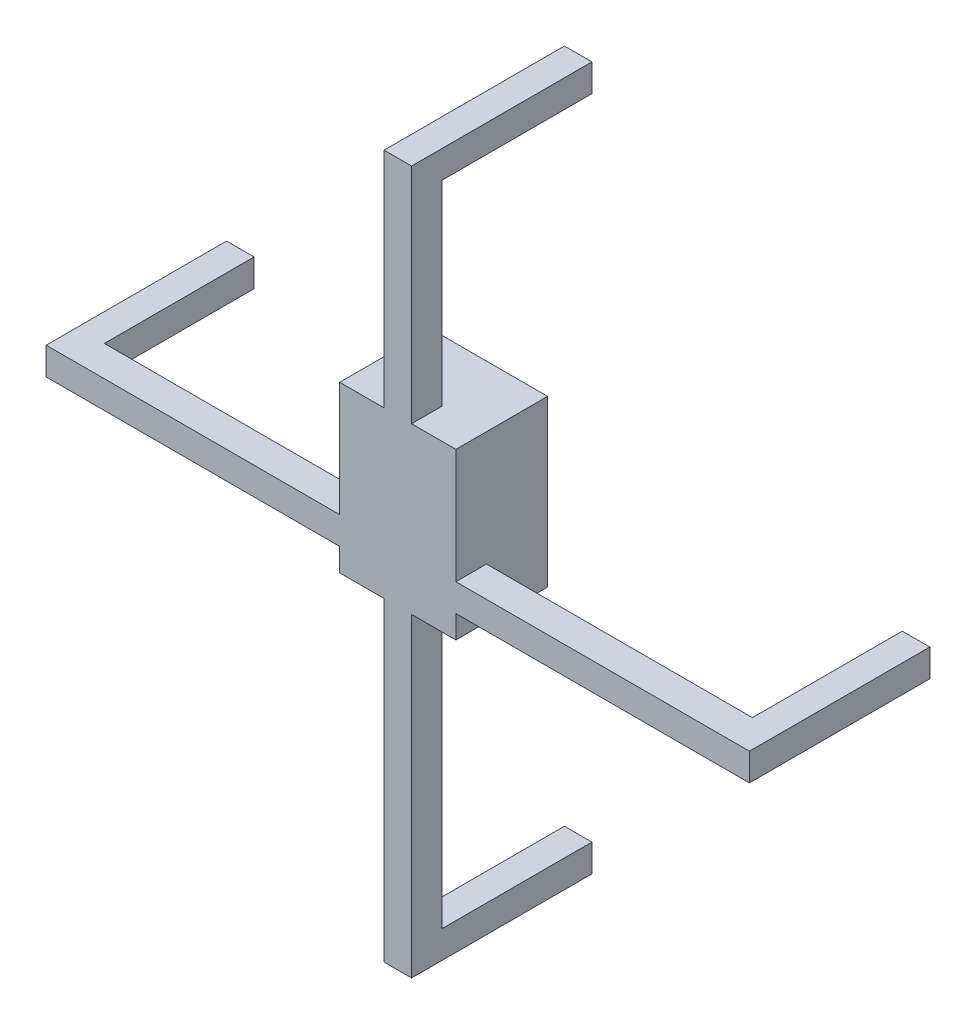
ISO-10303-21;
HEADER;
FILE_DESCRIPTION(('STEP AP214'),'2;1');
FILE_NAME('part.step','',(''),(''),'','','');
FILE_SCHEMA(('AUTOMOTIVE_DESIGN { 1 0 10303 214 1 1 1 1 }'));
ENDSEC;
DATA;
#1=APPLICATION_CONTEXT('core data for automotive mechanical design processes');
#2=APPLICATION_PROTOCOL_DEFINITION('international standard','automotive_design',2000,#1);
#3=PRODUCT_CONTEXT('',#1,'mechanical');
#4=PRODUCT('Part','Part','',(#3));
#5=PRODUCT_RELATED_PRODUCT_CATEGORY('part','',(#4));
#6=PRODUCT_DEFINITION_FORMATION('','',#4);
#7=PRODUCT_DEFINITION_CONTEXT('part definition',#1,'design');
#8=PRODUCT_DEFINITION('design','',#6,#7);
#9=PRODUCT_DEFINITION_SHAPE('','',#8);
#10=(LENGTH_UNIT() NAMED_UNIT(*) SI_UNIT(.MILLI.,.METRE.));
#11=(NAMED_UNIT(*) PLANE_ANGLE_UNIT() SI_UNIT($,.RADIAN.));
#12=(NAMED_UNIT(*) SI_UNIT($,.STERADIAN.) SOLID_ANGLE_UNIT());
#13=UNCERTAINTY_MEASURE_WITH_UNIT(LENGTH_MEASURE(1.E-05),#10,'distance_accuracy_value','');
#14=(GEOMETRIC_REPRESENTATION_CONTEXT(3) GLOBAL_UNCERTAINTY_ASSIGNED_CONTEXT((#13)) GLOBAL_UNIT_ASSIGNED_CONTEXT((#10,
#11,#12)) REPRESENTATION_CONTEXT('',''));
#15=CARTESIAN_POINT('',(0.,0.,0.));
#16=DIRECTION('',(0.,0.,1.));
#17=DIRECTION('',(1.,0.,0.));
#18=AXIS2_PLACEMENT_3D('',#15,#16,#17);
#19=CARTESIAN_POINT('',(0.,0.25,0.));
#20=DIRECTION('',(0.,1.,0.));
#21=DIRECTION('',(0.,0.,1.));
#22=AXIS2_PLACEMENT_3D('',#19,#20,#21);
#23=PLANE('',#22);
#24=DIRECTION('',(0.,0.,1.));
#25=VECTOR('',#24,1.);
#26=CARTESIAN_POINT('',(-57.5,0.25,3.99999999999999));
#27=LINE('',#26,#25);
#28=CARTESIAN_POINT('',(-57.5,0.25,-25.5));
#29=VERTEX_POINT('',#28);
#30=CARTESIAN_POINT('',(-57.5,0.25,3.99999999999999));
#31=VERTEX_POINT('',#30);
#32=EDGE_CURVE('E406',#29,#31,#27,.T.);
#33=ORIENTED_EDGE('',*,*,#32,.F.);
#34=DIRECTION('',(1.,0.,0.));
#35=VECTOR('',#34,1.);
#36=CARTESIAN_POINT('',(0.,0.25,-25.5));
#37=LINE('',#36,#35);
#38=CARTESIAN_POINT('',(-53.,0.25,-25.5));
#39=VERTEX_POINT('',#38);
#40=EDGE_CURVE('E565',#29,#39,#37,.T.);
#41=ORIENTED_EDGE('',*,*,#40,.T.);
#42=DIRECTION('',(0.,0.,-1.));
#43=VECTOR('',#42,1.);
#44=CARTESIAN_POINT('',(-53.,0.25,-27.5));
#45=LINE('',#44,#43);
#46=CARTESIAN_POINT('',(-53.,0.25,-1.00000000000001));
#47=VERTEX_POINT('',#46);
#48=EDGE_CURVE('E402',#47,#39,#45,.T.);
#49=ORIENTED_EDGE('',*,*,#48,.F.);
#50=DIRECTION('',(-1.,0.,0.));
#51=VECTOR('',#50,1.);
#52=CARTESIAN_POINT('',(-53.,0.25,-1.00000000000001));
#53=LINE('',#52,#51);
#54=CARTESIAN_POINT('',(-9.49999999999999,0.25,-1.00000000000001));
#55=VERTEX_POINT('',#54);
#56=EDGE_CURVE('E397',#55,#47,#53,.T.);
#57=ORIENTED_EDGE('',*,*,#56,.F.);
#58=DIRECTION('',(0.,0.,-1.));
#59=VECTOR('',#58,1.);
#60=CARTESIAN_POINT('',(-9.49999999999999,0.25,0.));
#61=LINE('',#60,#59);
#62=CARTESIAN_POINT('',(-9.49999999999999,0.25,4.));
#63=VERTEX_POINT('',#62);
#64=EDGE_CURVE('E492',#63,#55,#61,.T.);
#65=ORIENTED_EDGE('',*,*,#64,.F.);
#66=DIRECTION('',(1.,0.,0.));
#67=VECTOR('',#66,1.);
#68=CARTESIAN_POINT('',(-57.5,0.25,3.99999999999999));
#69=LINE('',#68,#67);
#70=EDGE_CURVE('E410',#31,#63,#69,.T.);
#71=ORIENTED_EDGE('',*,*,#70,.F.);
#72=EDGE_LOOP('',(#33,#41,#49,#57,#65,#71));
#73=FACE_BOUND('',#72,.T.);
#74=ADVANCED_FACE('F38',(#73),#23,.F.);
#75=CARTESIAN_POINT('',(0.,4.75,0.));
#76=DIRECTION('',(0.,1.,0.));
#77=DIRECTION('',(0.,0.,1.));
#78=AXIS2_PLACEMENT_3D('',#75,#76,#77);
#79=PLANE('',#78);
#80=DIRECTION('',(1.,0.,0.));
#81=VECTOR('',#80,1.);
#82=CARTESIAN_POINT('',(0.,4.75,-25.5));
#83=LINE('',#82,#81);
#84=CARTESIAN_POINT('',(-57.5,4.75,-25.5));
#85=VERTEX_POINT('',#84);
#86=CARTESIAN_POINT('',(-53.,4.75,-25.5));
#87=VERTEX_POINT('',#86);
#88=EDGE_CURVE('E62',#85,#87,#83,.T.);
#89=ORIENTED_EDGE('',*,*,#88,.F.);
#90=DIRECTION('',(0.,0.,1.));
#91=VECTOR('',#90,1.);
#92=CARTESIAN_POINT('',(-57.5,4.75,3.99999999999999));
#93=LINE('',#92,#91);
#94=CARTESIAN_POINT('',(-57.5,4.75,3.99999999999999));
#95=VERTEX_POINT('',#94);
#96=EDGE_CURVE('E382',#85,#95,#93,.T.);
#97=ORIENTED_EDGE('',*,*,#96,.T.);
#98=DIRECTION('',(1.,0.,0.));
#99=VECTOR('',#98,1.);
#100=CARTESIAN_POINT('',(-57.5,4.75,3.99999999999999));
#101=LINE('',#100,#99);
#102=CARTESIAN_POINT('',(-9.49999999999999,4.75,4.));
#103=VERTEX_POINT('',#102);
#104=EDGE_CURVE('E386',#95,#103,#101,.T.);
#105=ORIENTED_EDGE('',*,*,#104,.T.);
#106=DIRECTION('',(0.,0.,-1.));
#107=VECTOR('',#106,1.);
#108=CARTESIAN_POINT('',(-9.49999999999999,4.75,0.));
#109=LINE('',#108,#107);
#110=CARTESIAN_POINT('',(-9.49999999999999,4.75,-1.00000000000001));
#111=VERTEX_POINT('',#110);
#112=EDGE_CURVE('E489',#103,#111,#109,.T.);
#113=ORIENTED_EDGE('',*,*,#112,.T.);
#114=DIRECTION('',(-1.,0.,0.));
#115=VECTOR('',#114,1.);
#116=CARTESIAN_POINT('',(-53.,4.75,-1.00000000000001));
#117=LINE('',#116,#115);
#118=CARTESIAN_POINT('',(-53.,4.75,-1.00000000000001));
#119=VERTEX_POINT('',#118);
#120=EDGE_CURVE('E373',#111,#119,#117,.T.);
#121=ORIENTED_EDGE('',*,*,#120,.T.);
#122=DIRECTION('',(0.,0.,-1.));
#123=VECTOR('',#122,1.);
#124=CARTESIAN_POINT('',(-53.,4.75,-27.5));
#125=LINE('',#124,#123);
#126=EDGE_CURVE('E378',#119,#87,#125,.T.);
#127=ORIENTED_EDGE('',*,*,#126,.T.);
#128=EDGE_LOOP('',(#89,#97,#105,#113,#121,#127));
#129=FACE_BOUND('',#128,.T.);
#130=ADVANCED_FACE('F600',(#129),#79,.T.);
#131=DIRECTION('',(0.,0.,1.));
#132=VECTOR('',#131,1.);
#133=CARTESIAN_POINT('',(53.,0.25,-27.5));
#134=LINE('',#133,#132);
#135=CARTESIAN_POINT('',(53.,0.25,-25.5));
#136=VERTEX_POINT('',#135);
#137=CARTESIAN_POINT('',(53.,0.25,-1.00000000000001));
#138=VERTEX_POINT('',#137);
#139=EDGE_CURVE('E394',#136,#138,#134,.T.);
#140=ORIENTED_EDGE('',*,*,#139,.F.);
#141=DIRECTION('',(1.,0.,0.));
#142=VECTOR('',#141,1.);
#143=CARTESIAN_POINT('',(0.,0.25,-25.5));
#144=LINE('',#143,#142);
#145=CARTESIAN_POINT('',(57.5,0.25,-25.5));
#146=VERTEX_POINT('',#145);
#147=EDGE_CURVE('E577',#136,#146,#144,.T.);
#148=ORIENTED_EDGE('',*,*,#147,.T.);
#149=DIRECTION('',(0.,0.,-1.));
#150=VECTOR('',#149,1.);
#151=CARTESIAN_POINT('',(57.5,0.25,3.99999999999999));
#152=LINE('',#151,#150);
#153=CARTESIAN_POINT('',(57.5,0.25,3.99999999999999));
#154=VERTEX_POINT('',#153);
#155=EDGE_CURVE('E414',#154,#146,#152,.T.);
#156=ORIENTED_EDGE('',*,*,#155,.F.);
#157=CARTESIAN_POINT('',(9.49999999999999,0.25,3.99999999999999));
#158=VERTEX_POINT('',#157);
#159=EDGE_CURVE('E409',#158,#154,#69,.T.);
#160=ORIENTED_EDGE('',*,*,#159,.F.);
#161=DIRECTION('',(0.,0.,1.));
#162=VECTOR('',#161,1.);
#163=CARTESIAN_POINT('',(9.5,0.25,0.));
#164=LINE('',#163,#162);
#165=CARTESIAN_POINT('',(9.50000000000001,0.25,-1.00000000000001));
#166=VERTEX_POINT('',#165);
#167=EDGE_CURVE('E485',#166,#158,#164,.T.);
#168=ORIENTED_EDGE('',*,*,#167,.F.);
#169=EDGE_CURVE('E398',#138,#166,#53,.T.);
#170=ORIENTED_EDGE('',*,*,#169,.F.);
#171=EDGE_LOOP('',(#140,#148,#156,#160,#168,#170));
#172=FACE_BOUND('',#171,.T.);
#173=ADVANCED_FACE('F626',(#172),#23,.F.);
#174=DIRECTION('',(1.,0.,0.));
#175=VECTOR('',#174,1.);
#176=CARTESIAN_POINT('',(0.,4.75,-25.5));
#177=LINE('',#176,#175);
#178=CARTESIAN_POINT('',(53.,4.75,-25.5));
#179=VERTEX_POINT('',#178);
#180=CARTESIAN_POINT('',(57.5,4.75,-25.5));
#181=VERTEX_POINT('',#180);
#182=EDGE_CURVE('E54',#179,#181,#177,.T.);
#183=ORIENTED_EDGE('',*,*,#182,.F.);
#184=DIRECTION('',(0.,0.,1.));
#185=VECTOR('',#184,1.);
#186=CARTESIAN_POINT('',(53.,4.75,-27.5));
#187=LINE('',#186,#185);
#188=CARTESIAN_POINT('',(53.,4.75,-1.00000000000001));
#189=VERTEX_POINT('',#188);
#190=EDGE_CURVE('E370',#179,#189,#187,.T.);
#191=ORIENTED_EDGE('',*,*,#190,.T.);
#192=CARTESIAN_POINT('',(9.50000000000003,4.75,-1.00000000000001));
#193=VERTEX_POINT('',#192);
#194=EDGE_CURVE('E374',#189,#193,#117,.T.);
#195=ORIENTED_EDGE('',*,*,#194,.T.);
#196=DIRECTION('',(0.,0.,1.));
#197=VECTOR('',#196,1.);
#198=CARTESIAN_POINT('',(9.5,4.75,0.));
#199=LINE('',#198,#197);
#200=CARTESIAN_POINT('',(9.49999999999999,4.75,3.99999999999999));
#201=VERTEX_POINT('',#200);
#202=EDGE_CURVE('E482',#193,#201,#199,.T.);
#203=ORIENTED_EDGE('',*,*,#202,.T.);
#204=CARTESIAN_POINT('',(57.5,4.75,3.99999999999999));
#205=VERTEX_POINT('',#204);
#206=EDGE_CURVE('E385',#201,#205,#101,.T.);
#207=ORIENTED_EDGE('',*,*,#206,.T.);
#208=DIRECTION('',(0.,0.,-1.));
#209=VECTOR('',#208,1.);
#210=CARTESIAN_POINT('',(57.5,4.75,3.99999999999999));
#211=LINE('',#210,#209);
#212=EDGE_CURVE('E390',#205,#181,#211,.T.);
#213=ORIENTED_EDGE('',*,*,#212,.T.);
#214=EDGE_LOOP('',(#183,#191,#195,#203,#207,#213));
#215=FACE_BOUND('',#214,.T.);
#216=ADVANCED_FACE('F635',(#215),#79,.T.);
#217=CARTESIAN_POINT('',(-2.25,0.,0.));
#218=DIRECTION('',(1.,0.,0.));
#219=DIRECTION('',(0.,0.,-1.));
#220=AXIS2_PLACEMENT_3D('',#217,#218,#219);
#221=PLANE('',#220);
#222=DIRECTION('',(0.,0.,1.));
#223=VECTOR('',#222,1.);
#224=CARTESIAN_POINT('',(-2.25,60.,3.99999999999927));
#225=LINE('',#224,#223);
#226=CARTESIAN_POINT('',(-2.25,60.,-25.5));
#227=VERTEX_POINT('',#226);
#228=CARTESIAN_POINT('',(-2.25,60.,3.99999999999927));
#229=VERTEX_POINT('',#228);
#230=EDGE_CURVE('E522',#227,#229,#225,.T.);
#231=ORIENTED_EDGE('',*,*,#230,.F.);
#232=DIRECTION('',(0.,-1.,0.));
#233=VECTOR('',#232,1.);
#234=CARTESIAN_POINT('',(-2.25,0.,-25.5));
#235=LINE('',#234,#233);
#236=CARTESIAN_POINT('',(-2.25,55.5,-25.5));
#237=VERTEX_POINT('',#236);
#238=EDGE_CURVE('E553',#227,#237,#235,.T.);
#239=ORIENTED_EDGE('',*,*,#238,.T.);
#240=DIRECTION('',(0.,0.,-1.));
#241=VECTOR('',#240,1.);
#242=CARTESIAN_POINT('',(-2.25,55.5,-27.5));
#243=LINE('',#242,#241);
#244=CARTESIAN_POINT('',(-2.25,55.5,-1.));
#245=VERTEX_POINT('',#244);
#246=EDGE_CURVE('E519',#245,#237,#243,.T.);
#247=ORIENTED_EDGE('',*,*,#246,.F.);
#248=DIRECTION('',(0.,1.,0.));
#249=VECTOR('',#248,1.);
#250=CARTESIAN_POINT('',(-2.25,-50.5,-1.00000000000074));
#251=LINE('',#250,#249);
#252=CARTESIAN_POINT('',(-2.25,23.5,-1.00000000000001));
#253=VERTEX_POINT('',#252);
#254=EDGE_CURVE('E514',#253,#245,#251,.T.);
#255=ORIENTED_EDGE('',*,*,#254,.F.);
#256=DIRECTION('',(0.,0.,-1.));
#257=VECTOR('',#256,1.);
#258=CARTESIAN_POINT('',(-2.25,23.5,0.));
#259=LINE('',#258,#257);
#260=CARTESIAN_POINT('',(-2.25,23.5,4.));
#261=VERTEX_POINT('',#260);
#262=EDGE_CURVE('E479',#261,#253,#259,.T.);
#263=ORIENTED_EDGE('',*,*,#262,.F.);
#264=DIRECTION('',(0.,-1.,0.));
#265=VECTOR('',#264,1.);
#266=CARTESIAN_POINT('',(-2.25,-55.,3.99999999999926));
#267=LINE('',#266,#265);
#268=EDGE_CURVE('E272',#229,#261,#267,.T.);
#269=ORIENTED_EDGE('',*,*,#268,.F.);
#270=EDGE_LOOP('',(#231,#239,#247,#255,#263,#269));
#271=FACE_BOUND('',#270,.T.);
#272=ADVANCED_FACE('F661',(#271),#221,.F.);
#273=CARTESIAN_POINT('',(2.25,0.,0.));
#274=DIRECTION('',(1.,0.,0.));
#275=DIRECTION('',(0.,0.,-1.));
#276=AXIS2_PLACEMENT_3D('',#273,#274,#275);
#277=PLANE('',#276);
#278=DIRECTION('',(0.,-1.,0.));
#279=VECTOR('',#278,1.);
#280=CARTESIAN_POINT('',(2.25,0.,-25.5));
#281=LINE('',#280,#279);
#282=CARTESIAN_POINT('',(2.25,60.,-25.5));
#283=VERTEX_POINT('',#282);
#284=CARTESIAN_POINT('',(2.25,55.5,-25.5));
#285=VERTEX_POINT('',#284);
#286=EDGE_CURVE('E547',#283,#285,#281,.T.);
#287=ORIENTED_EDGE('',*,*,#286,.F.);
#288=DIRECTION('',(0.,0.,1.));
#289=VECTOR('',#288,1.);
#290=CARTESIAN_POINT('',(2.25,60.,3.99999999999927));
#291=LINE('',#290,#289);
#292=CARTESIAN_POINT('',(2.25,60.,3.99999999999927));
#293=VERTEX_POINT('',#292);
#294=EDGE_CURVE('E502',#283,#293,#291,.T.);
#295=ORIENTED_EDGE('',*,*,#294,.T.);
#296=DIRECTION('',(0.,-1.,0.));
#297=VECTOR('',#296,1.);
#298=CARTESIAN_POINT('',(2.25,-55.,3.99999999999926));
#299=LINE('',#298,#297);
#300=CARTESIAN_POINT('',(2.25,23.5,3.99999999999927));
#301=VERTEX_POINT('',#300);
#302=EDGE_CURVE('E505',#293,#301,#299,.T.);
#303=ORIENTED_EDGE('',*,*,#302,.T.);
#304=DIRECTION('',(0.,0.,-1.));
#305=VECTOR('',#304,1.);
#306=CARTESIAN_POINT('',(2.25,23.5,0.));
#307=LINE('',#306,#305);
#308=CARTESIAN_POINT('',(2.25,23.4999999999999,-1.00000000000022));
#309=VERTEX_POINT('',#308);
#310=EDGE_CURVE('E476',#301,#309,#307,.T.);
#311=ORIENTED_EDGE('',*,*,#310,.T.);
#312=DIRECTION('',(0.,1.,0.));
#313=VECTOR('',#312,1.);
#314=CARTESIAN_POINT('',(2.25,-50.5,-1.00000000000074));
#315=LINE('',#314,#313);
#316=CARTESIAN_POINT('',(2.25,55.5,-1.));
#317=VERTEX_POINT('',#316);
#318=EDGE_CURVE('E495',#309,#317,#315,.T.);
#319=ORIENTED_EDGE('',*,*,#318,.T.);
#320=DIRECTION('',(0.,0.,-1.));
#321=VECTOR('',#320,1.);
#322=CARTESIAN_POINT('',(2.25,55.5,-27.5));
#323=LINE('',#322,#321);
#324=EDGE_CURVE('E498',#317,#285,#323,.T.);
#325=ORIENTED_EDGE('',*,*,#324,.T.);
#326=EDGE_LOOP('',(#287,#295,#303,#311,#319,#325));
#327=FACE_BOUND('',#326,.T.);
#328=ADVANCED_FACE('F669',(#327),#277,.T.);
#329=DIRECTION('',(0.,0.,1.));
#330=VECTOR('',#329,1.);
#331=CARTESIAN_POINT('',(-2.25,-50.4999999999996,-27.5000000000007));
#332=LINE('',#331,#330);
#333=CARTESIAN_POINT('',(-2.25,-50.4999999999998,-25.5));
#334=VERTEX_POINT('',#333);
#335=CARTESIAN_POINT('',(-2.25,-50.5,-1.00000000000074));
#336=VERTEX_POINT('',#335);
#337=EDGE_CURVE('E263',#334,#336,#332,.T.);
#338=ORIENTED_EDGE('',*,*,#337,.F.);
#339=DIRECTION('',(0.,-1.,0.));
#340=VECTOR('',#339,1.);
#341=CARTESIAN_POINT('',(-2.25,0.,-25.5));
#342=LINE('',#341,#340);
#343=CARTESIAN_POINT('',(-2.25,-54.9999999999997,-25.5));
#344=VERTEX_POINT('',#343);
#345=EDGE_CURVE('E248',#334,#344,#342,.T.);
#346=ORIENTED_EDGE('',*,*,#345,.T.);
#347=DIRECTION('',(0.,0.,-1.));
#348=VECTOR('',#347,1.);
#349=CARTESIAN_POINT('',(-2.25,-55.,3.99999999999926));
#350=LINE('',#349,#348);
#351=CARTESIAN_POINT('',(-2.25,-55.,3.99999999999926));
#352=VERTEX_POINT('',#351);
#353=EDGE_CURVE('E261',#352,#344,#350,.T.);
#354=ORIENTED_EDGE('',*,*,#353,.F.);
#355=CARTESIAN_POINT('',(-2.25,-3.50000000000002,3.99999999999927));
#356=VERTEX_POINT('',#355);
#357=EDGE_CURVE('E279',#356,#352,#267,.T.);
#358=ORIENTED_EDGE('',*,*,#357,.F.);
#359=DIRECTION('',(0.,0.,1.));
#360=VECTOR('',#359,1.);
#361=CARTESIAN_POINT('',(-2.25,-3.5,0.));
#362=LINE('',#361,#360);
#363=CARTESIAN_POINT('',(-2.25,-3.5,-1.00000000000001));
#364=VERTEX_POINT('',#363);
#365=EDGE_CURVE('E472',#364,#356,#362,.T.);
#366=ORIENTED_EDGE('',*,*,#365,.F.);
#367=EDGE_CURVE('E515',#336,#364,#251,.T.);
#368=ORIENTED_EDGE('',*,*,#367,.F.);
#369=EDGE_LOOP('',(#338,#346,#354,#358,#366,#368));
#370=FACE_BOUND('',#369,.T.);
#371=ADVANCED_FACE('F259',(#370),#221,.F.);
#372=DIRECTION('',(0.,-1.,0.));
#373=VECTOR('',#372,1.);
#374=CARTESIAN_POINT('',(2.25,0.,-25.5));
#375=LINE('',#374,#373);
#376=CARTESIAN_POINT('',(2.25,-50.4999999999998,-25.5));
#377=VERTEX_POINT('',#376);
#378=CARTESIAN_POINT('',(2.25,-54.9999999999997,-25.5));
#379=VERTEX_POINT('',#378);
#380=EDGE_CURVE('E251',#377,#379,#375,.T.);
#381=ORIENTED_EDGE('',*,*,#380,.F.);
#382=DIRECTION('',(0.,0.,1.));
#383=VECTOR('',#382,1.);
#384=CARTESIAN_POINT('',(2.25,-50.4999999999996,-27.5000000000007));
#385=LINE('',#384,#383);
#386=CARTESIAN_POINT('',(2.25,-50.5,-1.00000000000074));
#387=VERTEX_POINT('',#386);
#388=EDGE_CURVE('E511',#377,#387,#385,.T.);
#389=ORIENTED_EDGE('',*,*,#388,.T.);
#390=CARTESIAN_POINT('',(2.25,-3.50000000000002,-1.00000000000041));
#391=VERTEX_POINT('',#390);
#392=EDGE_CURVE('E441',#387,#391,#315,.T.);
#393=ORIENTED_EDGE('',*,*,#392,.T.);
#394=DIRECTION('',(0.,0.,1.));
#395=VECTOR('',#394,1.);
#396=CARTESIAN_POINT('',(2.25,-3.5,0.));
#397=LINE('',#396,#395);
#398=CARTESIAN_POINT('',(2.25,-3.5,4.));
#399=VERTEX_POINT('',#398);
#400=EDGE_CURVE('E47',#391,#399,#397,.T.);
#401=ORIENTED_EDGE('',*,*,#400,.T.);
#402=CARTESIAN_POINT('',(2.25,-55.,3.99999999999926));
#403=VERTEX_POINT('',#402);
#404=EDGE_CURVE('E439',#399,#403,#299,.T.);
#405=ORIENTED_EDGE('',*,*,#404,.T.);
#406=DIRECTION('',(0.,0.,-1.));
#407=VECTOR('',#406,1.);
#408=CARTESIAN_POINT('',(2.25,-55.,3.99999999999926));
#409=LINE('',#408,#407);
#410=EDGE_CURVE('E508',#403,#379,#409,.T.);
#411=ORIENTED_EDGE('',*,*,#410,.T.);
#412=EDGE_LOOP('',(#381,#389,#393,#401,#405,#411));
#413=FACE_BOUND('',#412,.T.);
#414=ADVANCED_FACE('F438',(#413),#277,.T.);
#415=CARTESIAN_POINT('',(-53.,0.25,-1.00000000000001));
#416=DIRECTION('',(0.,0.,-1.));
#417=DIRECTION('',(-1.,0.,0.));
#418=AXIS2_PLACEMENT_3D('',#415,#416,#417);
#419=PLANE('',#418);
#420=ORIENTED_EDGE('',*,*,#169,.T.);
#421=DIRECTION('',(0.,-1.,0.));
#422=VECTOR('',#421,1.);
#423=CARTESIAN_POINT('',(9.5,-2.50000000000003,-1.00000000000001));
#424=LINE('',#423,#422);
#425=EDGE_CURVE('E328',#193,#166,#424,.T.);
#426=ORIENTED_EDGE('',*,*,#425,.F.);
#427=ORIENTED_EDGE('',*,*,#194,.F.);
#428=DIRECTION('',(0.,1.,0.));
#429=VECTOR('',#428,1.);
#430=CARTESIAN_POINT('',(53.,0.25,-1.00000000000001));
#431=LINE('',#430,#429);
#432=EDGE_CURVE('E418',#138,#189,#431,.T.);
#433=ORIENTED_EDGE('',*,*,#432,.F.);
#434=EDGE_LOOP('',(#420,#426,#427,#433));
#435=FACE_BOUND('',#434,.T.);
#436=ADVANCED_FACE('F709',(#435),#419,.T.);
#437=DIRECTION('',(1.,0.,0.));
#438=VECTOR('',#437,1.);
#439=CARTESIAN_POINT('',(-9.49999999999999,-3.5,-1.00000000000001));
#440=LINE('',#439,#438);
#441=CARTESIAN_POINT('',(-6.5,-3.5,-1.00000000000001));
#442=VERTEX_POINT('',#441);
#443=EDGE_CURVE('E539',#442,#364,#440,.T.);
#444=ORIENTED_EDGE('',*,*,#443,.F.);
#445=DIRECTION('',(0.,-1.,0.));
#446=VECTOR('',#445,1.);
#447=CARTESIAN_POINT('',(-6.5,-2.50000000000002,-1.00000000000001));
#448=LINE('',#447,#446);
#449=CARTESIAN_POINT('',(-6.5,20.5,-1.00000000000001));
#450=VERTEX_POINT('',#449);
#451=EDGE_CURVE('E338',#450,#442,#448,.T.);
#452=ORIENTED_EDGE('',*,*,#451,.F.);
#453=DIRECTION('',(-1.,0.,0.));
#454=VECTOR('',#453,1.);
#455=CARTESIAN_POINT('',(-6.5,20.5,-1.00000000000001));
#456=LINE('',#455,#454);
#457=CARTESIAN_POINT('',(6.5,20.5,-1.00000000000001));
#458=VERTEX_POINT('',#457);
#459=EDGE_CURVE('E335',#458,#450,#456,.T.);
#460=ORIENTED_EDGE('',*,*,#459,.F.);
#461=DIRECTION('',(0.,1.,0.));
#462=VECTOR('',#461,1.);
#463=CARTESIAN_POINT('',(6.5,20.5,-1.00000000000001));
#464=LINE('',#463,#462);
#465=CARTESIAN_POINT('',(6.5,-3.5,-1.00000000000001));
#466=VERTEX_POINT('',#465);
#467=EDGE_CURVE('E332',#466,#458,#464,.T.);
#468=ORIENTED_EDGE('',*,*,#467,.F.);
#469=EDGE_CURVE('E583',#391,#466,#440,.T.);
#470=ORIENTED_EDGE('',*,*,#469,.F.);
#471=ORIENTED_EDGE('',*,*,#392,.F.);
#472=DIRECTION('',(1.,0.,0.));
#473=VECTOR('',#472,1.);
#474=CARTESIAN_POINT('',(-2.25,-50.5,-1.00000000000074));
#475=LINE('',#474,#473);
#476=EDGE_CURVE('E283',#336,#387,#475,.T.);
#477=ORIENTED_EDGE('',*,*,#476,.F.);
#478=ORIENTED_EDGE('',*,*,#367,.T.);
#479=EDGE_LOOP('',(#444,#452,#460,#468,#470,#471,#477,#478));
#480=FACE_BOUND('',#479,.T.);
#481=ADVANCED_FACE('F537',(#480),#419,.T.);
#482=ORIENTED_EDGE('',*,*,#120,.F.);
#483=DIRECTION('',(0.,1.,0.));
#484=VECTOR('',#483,1.);
#485=CARTESIAN_POINT('',(-9.5,-2.50000000000002,-1.00000000000001));
#486=LINE('',#485,#484);
#487=EDGE_CURVE('E302',#55,#111,#486,.T.);
#488=ORIENTED_EDGE('',*,*,#487,.F.);
#489=ORIENTED_EDGE('',*,*,#56,.T.);
#490=DIRECTION('',(0.,1.,0.));
#491=VECTOR('',#490,1.);
#492=CARTESIAN_POINT('',(-53.,0.25,-1.00000000000001));
#493=LINE('',#492,#491);
#494=EDGE_CURVE('E427',#47,#119,#493,.T.);
#495=ORIENTED_EDGE('',*,*,#494,.T.);
#496=EDGE_LOOP('',(#482,#488,#489,#495));
#497=FACE_BOUND('',#496,.T.);
#498=ADVANCED_FACE('F611',(#497),#419,.T.);
#499=CARTESIAN_POINT('',(53.,0.25,-27.5));
#500=DIRECTION('',(-1.,0.,0.));
#501=DIRECTION('',(0.,0.,1.));
#502=AXIS2_PLACEMENT_3D('',#499,#500,#501);
#503=PLANE('',#502);
#504=DIRECTION('',(0.,1.,0.));
#505=VECTOR('',#504,1.);
#506=CARTESIAN_POINT('',(53.,0.25,-25.5));
#507=LINE('',#506,#505);
#508=EDGE_CURVE('E581',#136,#179,#507,.T.);
#509=ORIENTED_EDGE('',*,*,#508,.F.);
#510=ORIENTED_EDGE('',*,*,#139,.T.);
#511=ORIENTED_EDGE('',*,*,#432,.T.);
#512=ORIENTED_EDGE('',*,*,#190,.F.);
#513=EDGE_LOOP('',(#509,#510,#511,#512));
#514=FACE_BOUND('',#513,.T.);
#515=ADVANCED_FACE('F40',(#514),#503,.T.);
#516=CARTESIAN_POINT('',(57.5,0.25,3.99999999999999));
#517=DIRECTION('',(1.,0.,0.));
#518=DIRECTION('',(0.,0.,-1.));
#519=AXIS2_PLACEMENT_3D('',#516,#517,#518);
#520=PLANE('',#519);
#521=DIRECTION('',(0.,-1.,0.));
#522=VECTOR('',#521,1.);
#523=CARTESIAN_POINT('',(57.5,0.25,-25.5));
#524=LINE('',#523,#522);
#525=EDGE_CURVE('E572',#181,#146,#524,.T.);
#526=ORIENTED_EDGE('',*,*,#525,.F.);
#527=ORIENTED_EDGE('',*,*,#212,.F.);
#528=DIRECTION('',(0.,1.,0.));
#529=VECTOR('',#528,1.);
#530=CARTESIAN_POINT('',(57.5,0.25,3.99999999999999));
#531=LINE('',#530,#529);
#532=EDGE_CURVE('E419',#154,#205,#531,.T.);
#533=ORIENTED_EDGE('',*,*,#532,.F.);
#534=ORIENTED_EDGE('',*,*,#155,.T.);
#535=EDGE_LOOP('',(#526,#527,#533,#534));
#536=FACE_BOUND('',#535,.T.);
#537=ADVANCED_FACE('F624',(#536),#520,.T.);
#538=CARTESIAN_POINT('',(-57.5,0.25,3.99999999999999));
#539=DIRECTION('',(0.,0.,1.));
#540=DIRECTION('',(1.,0.,0.));
#541=AXIS2_PLACEMENT_3D('',#538,#539,#540);
#542=PLANE('',#541);
#543=DIRECTION('',(0.,1.,0.));
#544=VECTOR('',#543,1.);
#545=CARTESIAN_POINT('',(9.5,23.5,4.));
#546=LINE('',#545,#544);
#547=CARTESIAN_POINT('',(9.5,-3.5,4.));
#548=VERTEX_POINT('',#547);
#549=EDGE_CURVE('E464',#548,#158,#546,.T.);
#550=ORIENTED_EDGE('',*,*,#549,.T.);
#551=ORIENTED_EDGE('',*,*,#159,.T.);
#552=ORIENTED_EDGE('',*,*,#532,.T.);
#553=ORIENTED_EDGE('',*,*,#206,.F.);
#554=CARTESIAN_POINT('',(9.5,23.5,4.));
#555=VERTEX_POINT('',#554);
#556=EDGE_CURVE('E459',#201,#555,#546,.T.);
#557=ORIENTED_EDGE('',*,*,#556,.T.);
#558=DIRECTION('',(-1.,0.,0.));
#559=VECTOR('',#558,1.);
#560=CARTESIAN_POINT('',(-9.49999999999999,23.5,4.));
#561=LINE('',#560,#559);
#562=EDGE_CURVE('E467',#555,#301,#561,.T.);
#563=ORIENTED_EDGE('',*,*,#562,.T.);
#564=ORIENTED_EDGE('',*,*,#302,.F.);
#565=DIRECTION('',(1.,0.,0.));
#566=VECTOR('',#565,1.);
#567=CARTESIAN_POINT('',(-2.25,60.,3.99999999999927));
#568=LINE('',#567,#566);
#569=EDGE_CURVE('E290',#229,#293,#568,.T.);
#570=ORIENTED_EDGE('',*,*,#569,.F.);
#571=ORIENTED_EDGE('',*,*,#268,.T.);
#572=CARTESIAN_POINT('',(-9.49999999999999,23.5,4.));
#573=VERTEX_POINT('',#572);
#574=EDGE_CURVE('E471',#261,#573,#561,.T.);
#575=ORIENTED_EDGE('',*,*,#574,.T.);
#576=DIRECTION('',(0.,-1.,0.));
#577=VECTOR('',#576,1.);
#578=CARTESIAN_POINT('',(-9.49999999999999,23.5,4.));
#579=LINE('',#578,#577);
#580=EDGE_CURVE('E455',#573,#103,#579,.T.);
#581=ORIENTED_EDGE('',*,*,#580,.T.);
#582=ORIENTED_EDGE('',*,*,#104,.F.);
#583=DIRECTION('',(0.,1.,0.));
#584=VECTOR('',#583,1.);
#585=CARTESIAN_POINT('',(-57.5,0.25,3.99999999999999));
#586=LINE('',#585,#584);
#587=EDGE_CURVE('E423',#31,#95,#586,.T.);
#588=ORIENTED_EDGE('',*,*,#587,.F.);
#589=ORIENTED_EDGE('',*,*,#70,.T.);
#590=CARTESIAN_POINT('',(-9.49999999999999,-3.5,4.));
#591=VERTEX_POINT('',#590);
#592=EDGE_CURVE('E461',#63,#591,#579,.T.);
#593=ORIENTED_EDGE('',*,*,#592,.T.);
#594=DIRECTION('',(1.,0.,0.));
#595=VECTOR('',#594,1.);
#596=CARTESIAN_POINT('',(-9.49999999999999,-3.5,4.));
#597=LINE('',#596,#595);
#598=EDGE_CURVE('E454',#591,#356,#597,.T.);
#599=ORIENTED_EDGE('',*,*,#598,.T.);
#600=ORIENTED_EDGE('',*,*,#357,.T.);
#601=DIRECTION('',(1.,0.,0.));
#602=VECTOR('',#601,1.);
#603=CARTESIAN_POINT('',(-2.25,-55.,3.99999999999926));
#604=LINE('',#603,#602);
#605=EDGE_CURVE('E270',#352,#403,#604,.T.);
#606=ORIENTED_EDGE('',*,*,#605,.T.);
#607=ORIENTED_EDGE('',*,*,#404,.F.);
#608=EDGE_CURVE('E446',#399,#548,#597,.T.);
#609=ORIENTED_EDGE('',*,*,#608,.T.);
#610=EDGE_LOOP('',(#550,#551,#552,#553,#557,#563,#564,#570,#571,#575,#581,#582,#588,#589,#593,
#599,#600,#606,#607,#609));
#611=FACE_BOUND('',#610,.T.);
#612=ADVANCED_FACE('F529',(#611),#542,.T.);
#613=CARTESIAN_POINT('',(-57.5,0.25,3.99999999999999));
#614=DIRECTION('',(-1.,0.,0.));
#615=DIRECTION('',(0.,0.,1.));
#616=AXIS2_PLACEMENT_3D('',#613,#614,#615);
#617=PLANE('',#616);
#618=DIRECTION('',(0.,1.,0.));
#619=VECTOR('',#618,1.);
#620=CARTESIAN_POINT('',(-57.5,0.25,-25.5));
#621=LINE('',#620,#619);
#622=EDGE_CURVE('E569',#29,#85,#621,.T.);
#623=ORIENTED_EDGE('',*,*,#622,.F.);
#624=ORIENTED_EDGE('',*,*,#32,.T.);
#625=ORIENTED_EDGE('',*,*,#587,.T.);
#626=ORIENTED_EDGE('',*,*,#96,.F.);
#627=EDGE_LOOP('',(#623,#624,#625,#626));
#628=FACE_BOUND('',#627,.T.);
#629=ADVANCED_FACE('F681',(#628),#617,.T.);
#630=CARTESIAN_POINT('',(-53.,0.25,-27.5));
#631=DIRECTION('',(1.,0.,0.));
#632=DIRECTION('',(0.,0.,-1.));
#633=AXIS2_PLACEMENT_3D('',#630,#631,#632);
#634=PLANE('',#633);
#635=DIRECTION('',(0.,-1.,0.));
#636=VECTOR('',#635,1.);
#637=CARTESIAN_POINT('',(-53.,0.25,-25.5));
#638=LINE('',#637,#636);
#639=EDGE_CURVE('E560',#87,#39,#638,.T.);
#640=ORIENTED_EDGE('',*,*,#639,.F.);
#641=ORIENTED_EDGE('',*,*,#126,.F.);
#642=ORIENTED_EDGE('',*,*,#494,.F.);
#643=ORIENTED_EDGE('',*,*,#48,.T.);
#644=EDGE_LOOP('',(#640,#641,#642,#643));
#645=FACE_BOUND('',#644,.T.);
#646=ADVANCED_FACE('F673',(#645),#634,.T.);
#647=CARTESIAN_POINT('',(-9.49999999999999,23.5,-11.));
#648=DIRECTION('',(0.,-1.,0.));
#649=DIRECTION('',(0.,0.,-1.));
#650=AXIS2_PLACEMENT_3D('',#647,#648,#649);
#651=PLANE('',#650);
#652=DIRECTION('',(0.,0.,1.));
#653=VECTOR('',#652,1.);
#654=CARTESIAN_POINT('',(-9.49999999999999,23.5,-11.));
#655=LINE('',#654,#653);
#656=CARTESIAN_POINT('',(-9.49999999999999,23.5,-11.));
#657=VERTEX_POINT('',#656);
#658=EDGE_CURVE('E367',#657,#573,#655,.T.);
#659=ORIENTED_EDGE('',*,*,#658,.T.);
#660=ORIENTED_EDGE('',*,*,#574,.F.);
#661=ORIENTED_EDGE('',*,*,#262,.T.);
#662=DIRECTION('',(1.,0.,0.));
#663=VECTOR('',#662,1.);
#664=CARTESIAN_POINT('',(-9.49999999999999,23.5,-1.00000000000001));
#665=LINE('',#664,#663);
#666=EDGE_CURVE('E287',#253,#309,#665,.T.);
#667=ORIENTED_EDGE('',*,*,#666,.T.);
#668=ORIENTED_EDGE('',*,*,#310,.F.);
#669=ORIENTED_EDGE('',*,*,#562,.F.);
#670=DIRECTION('',(0.,0.,1.));
#671=VECTOR('',#670,1.);
#672=CARTESIAN_POINT('',(9.5,23.5,-11.));
#673=LINE('',#672,#671);
#674=CARTESIAN_POINT('',(9.5,23.5,-11.));
#675=VERTEX_POINT('',#674);
#676=EDGE_CURVE('E364',#675,#555,#673,.T.);
#677=ORIENTED_EDGE('',*,*,#676,.F.);
#678=DIRECTION('',(1.,0.,0.));
#679=VECTOR('',#678,1.);
#680=CARTESIAN_POINT('',(-9.49999999999999,23.5,-11.));
#681=LINE('',#680,#679);
#682=EDGE_CURVE('E301',#657,#675,#681,.T.);
#683=ORIENTED_EDGE('',*,*,#682,.F.);
#684=EDGE_LOOP('',(#659,#660,#661,#667,#668,#669,#677,#683));
#685=FACE_BOUND('',#684,.T.);
#686=ADVANCED_FACE('F671',(#685),#651,.F.);
#687=CARTESIAN_POINT('',(9.5,-2.50000000000003,-11.));
#688=DIRECTION('',(-1.,0.,0.));
#689=DIRECTION('',(0.,-1.,0.));
#690=AXIS2_PLACEMENT_3D('',#687,#688,#689);
#691=PLANE('',#690);
#692=ORIENTED_EDGE('',*,*,#676,.T.);
#693=ORIENTED_EDGE('',*,*,#556,.F.);
#694=ORIENTED_EDGE('',*,*,#202,.F.);
#695=ORIENTED_EDGE('',*,*,#425,.T.);
#696=ORIENTED_EDGE('',*,*,#167,.T.);
#697=ORIENTED_EDGE('',*,*,#549,.F.);
#698=DIRECTION('',(0.,0.,1.));
#699=VECTOR('',#698,1.);
#700=CARTESIAN_POINT('',(9.5,-3.5,-11.));
#701=LINE('',#700,#699);
#702=CARTESIAN_POINT('',(9.5,-3.5,-11.));
#703=VERTEX_POINT('',#702);
#704=EDGE_CURVE('E361',#703,#548,#701,.T.);
#705=ORIENTED_EDGE('',*,*,#704,.F.);
#706=DIRECTION('',(0.,-1.,0.));
#707=VECTOR('',#706,1.);
#708=CARTESIAN_POINT('',(9.5,23.5,-11.));
#709=LINE('',#708,#707);
#710=EDGE_CURVE('E305',#675,#703,#709,.T.);
#711=ORIENTED_EDGE('',*,*,#710,.F.);
#712=EDGE_LOOP('',(#692,#693,#694,#695,#696,#697,#705,#711));
#713=FACE_BOUND('',#712,.T.);
#714=ADVANCED_FACE('F641',(#713),#691,.F.);
#715=CARTESIAN_POINT('',(9.5,-3.5,-11.));
#716=DIRECTION('',(0.,1.,0.));
#717=DIRECTION('',(0.,0.,1.));
#718=AXIS2_PLACEMENT_3D('',#715,#716,#717);
#719=PLANE('',#718);
#720=ORIENTED_EDGE('',*,*,#704,.T.);
#721=ORIENTED_EDGE('',*,*,#608,.F.);
#722=ORIENTED_EDGE('',*,*,#400,.F.);
#723=ORIENTED_EDGE('',*,*,#469,.T.);
#724=DIRECTION('',(0.,0.,1.));
#725=VECTOR('',#724,1.);
#726=CARTESIAN_POINT('',(6.5,-3.5,-11.));
#727=LINE('',#726,#725);
#728=CARTESIAN_POINT('',(6.5,-3.5,-11.));
#729=VERTEX_POINT('',#728);
#730=EDGE_CURVE('E358',#729,#466,#727,.T.);
#731=ORIENTED_EDGE('',*,*,#730,.F.);
#732=DIRECTION('',(-1.,0.,0.));
#733=VECTOR('',#732,1.);
#734=CARTESIAN_POINT('',(9.5,-3.5,-11.));
#735=LINE('',#734,#733);
#736=EDGE_CURVE('E308',#703,#729,#735,.T.);
#737=ORIENTED_EDGE('',*,*,#736,.F.);
#738=EDGE_LOOP('',(#720,#721,#722,#723,#731,#737));
#739=FACE_BOUND('',#738,.T.);
#740=ADVANCED_FACE('F447',(#739),#719,.F.);
#741=CARTESIAN_POINT('',(6.5,20.5,-11.));
#742=DIRECTION('',(1.,0.,0.));
#743=DIRECTION('',(0.,1.,0.));
#744=AXIS2_PLACEMENT_3D('',#741,#742,#743);
#745=PLANE('',#744);
#746=ORIENTED_EDGE('',*,*,#467,.T.);
#747=DIRECTION('',(0.,0.,1.));
#748=VECTOR('',#747,1.);
#749=CARTESIAN_POINT('',(6.5,20.5,-11.));
#750=LINE('',#749,#748);
#751=CARTESIAN_POINT('',(6.5,20.5,-11.));
#752=VERTEX_POINT('',#751);
#753=EDGE_CURVE('E354',#752,#458,#750,.T.);
#754=ORIENTED_EDGE('',*,*,#753,.F.);
#755=DIRECTION('',(0.,1.,0.));
#756=VECTOR('',#755,1.);
#757=CARTESIAN_POINT('',(6.5,-2.50000000000003,-11.));
#758=LINE('',#757,#756);
#759=EDGE_CURVE('E311',#729,#752,#758,.T.);
#760=ORIENTED_EDGE('',*,*,#759,.F.);
#761=ORIENTED_EDGE('',*,*,#730,.T.);
#762=EDGE_LOOP('',(#746,#754,#760,#761));
#763=FACE_BOUND('',#762,.T.);
#764=ADVANCED_FACE('F832',(#763),#745,.F.);
#765=CARTESIAN_POINT('',(-6.5,20.5,-11.));
#766=DIRECTION('',(0.,1.,0.));
#767=DIRECTION('',(0.,0.,1.));
#768=AXIS2_PLACEMENT_3D('',#765,#766,#767);
#769=PLANE('',#768);
#770=ORIENTED_EDGE('',*,*,#459,.T.);
#771=DIRECTION('',(0.,0.,1.));
#772=VECTOR('',#771,1.);
#773=CARTESIAN_POINT('',(-6.5,20.5,-11.));
#774=LINE('',#773,#772);
#775=CARTESIAN_POINT('',(-6.5,20.5,-11.));
#776=VERTEX_POINT('',#775);
#777=EDGE_CURVE('E350',#776,#450,#774,.T.);
#778=ORIENTED_EDGE('',*,*,#777,.F.);
#779=DIRECTION('',(-1.,0.,0.));
#780=VECTOR('',#779,1.);
#781=CARTESIAN_POINT('',(-6.5,20.5,-11.));
#782=LINE('',#781,#780);
#783=EDGE_CURVE('E314',#752,#776,#782,.T.);
#784=ORIENTED_EDGE('',*,*,#783,.F.);
#785=ORIENTED_EDGE('',*,*,#753,.T.);
#786=EDGE_LOOP('',(#770,#778,#784,#785));
#787=FACE_BOUND('',#786,.T.);
#788=ADVANCED_FACE('F941',(#787),#769,.F.);
#789=CARTESIAN_POINT('',(-6.5,-2.50000000000002,-11.));
#790=DIRECTION('',(-1.,0.,0.));
#791=DIRECTION('',(0.,0.,1.));
#792=AXIS2_PLACEMENT_3D('',#789,#790,#791);
#793=PLANE('',#792);
#794=ORIENTED_EDGE('',*,*,#451,.T.);
#795=DIRECTION('',(0.,0.,1.));
#796=VECTOR('',#795,1.);
#797=CARTESIAN_POINT('',(-6.5,-3.5,-11.));
#798=LINE('',#797,#796);
#799=CARTESIAN_POINT('',(-6.5,-3.5,-11.));
#800=VERTEX_POINT('',#799);
#801=EDGE_CURVE('E346',#800,#442,#798,.T.);
#802=ORIENTED_EDGE('',*,*,#801,.F.);
#803=DIRECTION('',(0.,-1.,0.));
#804=VECTOR('',#803,1.);
#805=CARTESIAN_POINT('',(-6.5,20.5,-11.));
#806=LINE('',#805,#804);
#807=EDGE_CURVE('E317',#776,#800,#806,.T.);
#808=ORIENTED_EDGE('',*,*,#807,.F.);
#809=ORIENTED_EDGE('',*,*,#777,.T.);
#810=EDGE_LOOP('',(#794,#802,#808,#809));
#811=FACE_BOUND('',#810,.T.);
#812=ADVANCED_FACE('F846',(#811),#793,.F.);
#813=CARTESIAN_POINT('',(-9.5,-3.5,-11.));
#814=DIRECTION('',(0.,1.,0.));
#815=DIRECTION('',(0.,0.,1.));
#816=AXIS2_PLACEMENT_3D('',#813,#814,#815);
#817=PLANE('',#816);
#818=ORIENTED_EDGE('',*,*,#801,.T.);
#819=ORIENTED_EDGE('',*,*,#443,.T.);
#820=ORIENTED_EDGE('',*,*,#365,.T.);
#821=ORIENTED_EDGE('',*,*,#598,.F.);
#822=DIRECTION('',(0.,0.,1.));
#823=VECTOR('',#822,1.);
#824=CARTESIAN_POINT('',(-9.5,-3.5,-11.));
#825=LINE('',#824,#823);
#826=CARTESIAN_POINT('',(-9.5,-3.5,-11.));
#827=VERTEX_POINT('',#826);
#828=EDGE_CURVE('E324',#827,#591,#825,.T.);
#829=ORIENTED_EDGE('',*,*,#828,.F.);
#830=DIRECTION('',(-1.,0.,0.));
#831=VECTOR('',#830,1.);
#832=CARTESIAN_POINT('',(-9.5,-3.5,-11.));
#833=LINE('',#832,#831);
#834=EDGE_CURVE('E320',#800,#827,#833,.T.);
#835=ORIENTED_EDGE('',*,*,#834,.F.);
#836=EDGE_LOOP('',(#818,#819,#820,#821,#829,#835));
#837=FACE_BOUND('',#836,.T.);
#838=ADVANCED_FACE('F839',(#837),#817,.F.);
#839=CARTESIAN_POINT('',(-9.5,-2.50000000000002,-11.));
#840=DIRECTION('',(1.,0.,0.));
#841=DIRECTION('',(0.,0.,-1.));
#842=AXIS2_PLACEMENT_3D('',#839,#840,#841);
#843=PLANE('',#842);
#844=ORIENTED_EDGE('',*,*,#828,.T.);
#845=ORIENTED_EDGE('',*,*,#592,.F.);
#846=ORIENTED_EDGE('',*,*,#64,.T.);
#847=ORIENTED_EDGE('',*,*,#487,.T.);
#848=ORIENTED_EDGE('',*,*,#112,.F.);
#849=ORIENTED_EDGE('',*,*,#580,.F.);
#850=ORIENTED_EDGE('',*,*,#658,.F.);
#851=DIRECTION('',(0.,1.,0.));
#852=VECTOR('',#851,1.);
#853=CARTESIAN_POINT('',(-9.49999999999999,23.5,-11.));
#854=LINE('',#853,#852);
#855=EDGE_CURVE('E297',#827,#657,#854,.T.);
#856=ORIENTED_EDGE('',*,*,#855,.F.);
#857=EDGE_LOOP('',(#844,#845,#846,#847,#848,#849,#850,#856));
#858=FACE_BOUND('',#857,.T.);
#859=ADVANCED_FACE('F596',(#858),#843,.F.);
#860=CARTESIAN_POINT('',(0.,0.,-11.));
#861=DIRECTION('',(0.,0.,1.));
#862=DIRECTION('',(1.,0.,0.));
#863=AXIS2_PLACEMENT_3D('',#860,#861,#862);
#864=PLANE('',#863);
#865=ORIENTED_EDGE('',*,*,#855,.T.);
#866=ORIENTED_EDGE('',*,*,#682,.T.);
#867=ORIENTED_EDGE('',*,*,#710,.T.);
#868=ORIENTED_EDGE('',*,*,#736,.T.);
#869=ORIENTED_EDGE('',*,*,#759,.T.);
#870=ORIENTED_EDGE('',*,*,#783,.T.);
#871=ORIENTED_EDGE('',*,*,#807,.T.);
#872=ORIENTED_EDGE('',*,*,#834,.T.);
#873=EDGE_LOOP('',(#865,#866,#867,#868,#869,#870,#871,#872));
#874=FACE_BOUND('',#873,.T.);
#875=ADVANCED_FACE('F860',(#874),#864,.F.);
#876=CARTESIAN_POINT('',(-2.25,60.,3.99999999999927));
#877=DIRECTION('',(0.,1.,0.));
#878=DIRECTION('',(0.,0.,1.));
#879=AXIS2_PLACEMENT_3D('',#876,#877,#878);
#880=PLANE('',#879);
#881=DIRECTION('',(1.,0.,0.));
#882=VECTOR('',#881,1.);
#883=CARTESIAN_POINT('',(-2.25,60.,-25.5));
#884=LINE('',#883,#882);
#885=EDGE_CURVE('E557',#227,#283,#884,.T.);
#886=ORIENTED_EDGE('',*,*,#885,.F.);
#887=ORIENTED_EDGE('',*,*,#230,.T.);
#888=ORIENTED_EDGE('',*,*,#569,.T.);
#889=ORIENTED_EDGE('',*,*,#294,.F.);
#890=EDGE_LOOP('',(#886,#887,#888,#889));
#891=FACE_BOUND('',#890,.T.);
#892=ADVANCED_FACE('F666',(#891),#880,.T.);
#893=CARTESIAN_POINT('',(-2.25,55.5,-27.5));
#894=DIRECTION('',(0.,-1.,0.));
#895=DIRECTION('',(0.,0.,-1.));
#896=AXIS2_PLACEMENT_3D('',#893,#894,#895);
#897=PLANE('',#896);
#898=DIRECTION('',(-1.,0.,0.));
#899=VECTOR('',#898,1.);
#900=CARTESIAN_POINT('',(-2.25,55.5,-25.5));
#901=LINE('',#900,#899);
#902=EDGE_CURVE('E544',#285,#237,#901,.T.);
#903=ORIENTED_EDGE('',*,*,#902,.F.);
#904=ORIENTED_EDGE('',*,*,#324,.F.);
#905=DIRECTION('',(1.,0.,0.));
#906=VECTOR('',#905,1.);
#907=CARTESIAN_POINT('',(-2.25,55.5,-1.));
#908=LINE('',#907,#906);
#909=EDGE_CURVE('E276',#245,#317,#908,.T.);
#910=ORIENTED_EDGE('',*,*,#909,.F.);
#911=ORIENTED_EDGE('',*,*,#246,.T.);
#912=EDGE_LOOP('',(#903,#904,#910,#911));
#913=FACE_BOUND('',#912,.T.);
#914=ADVANCED_FACE('F660',(#913),#897,.T.);
#915=CARTESIAN_POINT('',(-2.25,-50.5,-1.00000000000074));
#916=DIRECTION('',(0.,0.,-1.));
#917=DIRECTION('',(0.,1.,0.));
#918=AXIS2_PLACEMENT_3D('',#915,#916,#917);
#919=PLANE('',#918);
#920=ORIENTED_EDGE('',*,*,#666,.F.);
#921=ORIENTED_EDGE('',*,*,#254,.T.);
#922=ORIENTED_EDGE('',*,*,#909,.T.);
#923=ORIENTED_EDGE('',*,*,#318,.F.);
#924=EDGE_LOOP('',(#920,#921,#922,#923));
#925=FACE_BOUND('',#924,.T.);
#926=ADVANCED_FACE('F653',(#925),#919,.T.);
#927=CARTESIAN_POINT('',(-2.25,-50.4999999999996,-27.5000000000007));
#928=DIRECTION('',(0.,1.,0.));
#929=DIRECTION('',(0.,0.,1.));
#930=AXIS2_PLACEMENT_3D('',#927,#928,#929);
#931=PLANE('',#930);
#932=DIRECTION('',(1.,0.,0.));
#933=VECTOR('',#932,1.);
#934=CARTESIAN_POINT('',(-2.25,-50.4999999999997,-25.5));
#935=LINE('',#934,#933);
#936=EDGE_CURVE('E265',#334,#377,#935,.T.);
#937=ORIENTED_EDGE('',*,*,#936,.F.);
#938=ORIENTED_EDGE('',*,*,#337,.T.);
#939=ORIENTED_EDGE('',*,*,#476,.T.);
#940=ORIENTED_EDGE('',*,*,#388,.F.);
#941=EDGE_LOOP('',(#937,#938,#939,#940));
#942=FACE_BOUND('',#941,.T.);
#943=ADVANCED_FACE('F542',(#942),#931,.T.);
#944=CARTESIAN_POINT('',(-2.25,-55.,3.99999999999926));
#945=DIRECTION('',(0.,-1.,0.));
#946=DIRECTION('',(0.,0.,-1.));
#947=AXIS2_PLACEMENT_3D('',#944,#945,#946);
#948=PLANE('',#947);
#949=DIRECTION('',(-1.,0.,0.));
#950=VECTOR('',#949,1.);
#951=CARTESIAN_POINT('',(-2.25,-54.9999999999997,-25.5));
#952=LINE('',#951,#950);
#953=EDGE_CURVE('E11',#379,#344,#952,.T.);
#954=ORIENTED_EDGE('',*,*,#953,.F.);
#955=ORIENTED_EDGE('',*,*,#410,.F.);
#956=ORIENTED_EDGE('',*,*,#605,.F.);
#957=ORIENTED_EDGE('',*,*,#353,.T.);
#958=EDGE_LOOP('',(#954,#955,#956,#957));
#959=FACE_BOUND('',#958,.T.);
#960=ADVANCED_FACE('F268',(#959),#948,.T.);
#961=CARTESIAN_POINT('',(0.,0.,-25.5));
#962=DIRECTION('',(0.,0.,1.));
#963=DIRECTION('',(1.,0.,0.));
#964=AXIS2_PLACEMENT_3D('',#961,#962,#963);
#965=PLANE('',#964);
#966=ORIENTED_EDGE('',*,*,#936,.T.);
#967=ORIENTED_EDGE('',*,*,#380,.T.);
#968=ORIENTED_EDGE('',*,*,#953,.T.);
#969=ORIENTED_EDGE('',*,*,#345,.F.);
#970=EDGE_LOOP('',(#966,#967,#968,#969));
#971=FACE_BOUND('',#970,.T.);
#972=ADVANCED_FACE('F247',(#971),#965,.F.);
#973=ORIENTED_EDGE('',*,*,#885,.T.);
#974=ORIENTED_EDGE('',*,*,#286,.T.);
#975=ORIENTED_EDGE('',*,*,#902,.T.);
#976=ORIENTED_EDGE('',*,*,#238,.F.);
#977=EDGE_LOOP('',(#973,#974,#975,#976));
#978=FACE_BOUND('',#977,.T.);
#979=ADVANCED_FACE('F663',(#978),#965,.F.);
#980=ORIENTED_EDGE('',*,*,#622,.T.);
#981=ORIENTED_EDGE('',*,*,#88,.T.);
#982=ORIENTED_EDGE('',*,*,#639,.T.);
#983=ORIENTED_EDGE('',*,*,#40,.F.);
#984=EDGE_LOOP('',(#980,#981,#982,#983));
#985=FACE_BOUND('',#984,.T.);
#986=ADVANCED_FACE('F721',(#985),#965,.F.);
#987=ORIENTED_EDGE('',*,*,#508,.T.);
#988=ORIENTED_EDGE('',*,*,#182,.T.);
#989=ORIENTED_EDGE('',*,*,#525,.T.);
#990=ORIENTED_EDGE('',*,*,#147,.F.);
#991=EDGE_LOOP('',(#987,#988,#989,#990));
#992=FACE_BOUND('',#991,.T.);
#993=ADVANCED_FACE('F629',(#992),#965,.F.);
#994=CLOSED_SHELL('',(#74,#130,#173,#216,#272,#328,#371,#414,#436,#481,#498,#515,#537,#612,#629,
#646,#686,#714,#740,#764,#788,#812,#838,#859,#875,#892,#914,#926,#943,#960,#972,#979,#986,#993));
#995=MANIFOLD_SOLID_BREP('B2',#994);
#996=ADVANCED_BREP_SHAPE_REPRESENTATION('',(#18,#995),#14);
#997=SHAPE_DEFINITION_REPRESENTATION(#9,#996);
ENDSEC;
END-ISO-10303-21;
